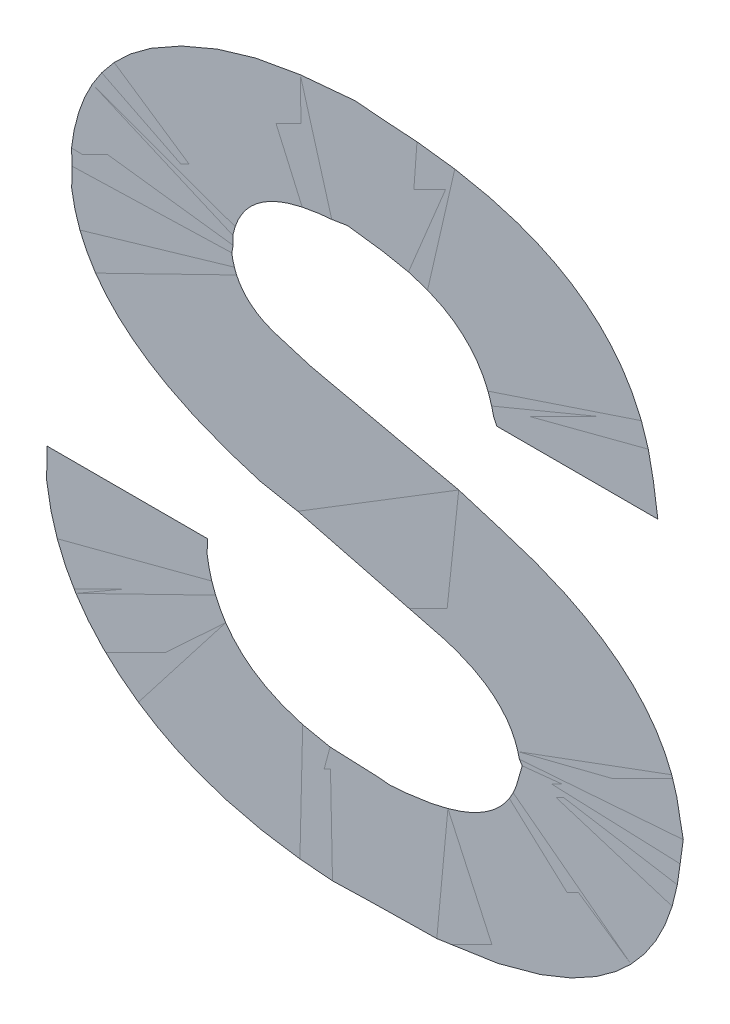
ISO-10303-21;
HEADER;
FILE_DESCRIPTION(('STEP AP214'),'2;1');
FILE_NAME('part.step','',(''),(''),'','','');
FILE_SCHEMA(('AUTOMOTIVE_DESIGN { 1 0 10303 214 1 1 1 1 }'));
ENDSEC;
DATA;
#1=APPLICATION_CONTEXT('core data for automotive mechanical design processes');
#2=APPLICATION_PROTOCOL_DEFINITION('international standard','automotive_design',2000,#1);
#3=PRODUCT_CONTEXT('',#1,'mechanical');
#4=PRODUCT('Part','Part','',(#3));
#5=PRODUCT_RELATED_PRODUCT_CATEGORY('part','',(#4));
#6=PRODUCT_DEFINITION_FORMATION('','',#4);
#7=PRODUCT_DEFINITION_CONTEXT('part definition',#1,'design');
#8=PRODUCT_DEFINITION('design','',#6,#7);
#9=PRODUCT_DEFINITION_SHAPE('','',#8);
#10=(LENGTH_UNIT() NAMED_UNIT(*) SI_UNIT(.MILLI.,.METRE.));
#11=(NAMED_UNIT(*) PLANE_ANGLE_UNIT() SI_UNIT($,.RADIAN.));
#12=(NAMED_UNIT(*) SI_UNIT($,.STERADIAN.) SOLID_ANGLE_UNIT());
#13=UNCERTAINTY_MEASURE_WITH_UNIT(LENGTH_MEASURE(1.E-05),#10,'distance_accuracy_value','');
#14=(GEOMETRIC_REPRESENTATION_CONTEXT(3) GLOBAL_UNCERTAINTY_ASSIGNED_CONTEXT((#13)) GLOBAL_UNIT_ASSIGNED_CONTEXT((#10,
#11,#12)) REPRESENTATION_CONTEXT('',''));
#15=CARTESIAN_POINT('',(0.,0.,0.));
#16=DIRECTION('',(0.,0.,1.));
#17=DIRECTION('',(1.,0.,0.));
#18=AXIS2_PLACEMENT_3D('',#15,#16,#17);
#19=CARTESIAN_POINT('',(-0.110404161724,0.771405147182,0.00045));
#20=DIRECTION('',(0.,0.,1.));
#21=DIRECTION('',(1.,0.,0.));
#22=AXIS2_PLACEMENT_3D('',#19,#20,#21);
#23=PLANE('',#22);
#24=CARTESIAN_POINT('',(-0.118370335149,0.807719203332,0.00045));
#25=CARTESIAN_POINT('',(-0.102137735696251,0.803973408793768,0.00045));
#26=CARTESIAN_POINT('',(-0.099843290192775,0.80323429342325,0.00045));
#27=CARTESIAN_POINT('',(-0.092115900013415,0.800745050228369,0.00045));
#28=CARTESIAN_POINT('',(-0.09135319969905,0.794696203597,0.00045));
#29=B_SPLINE_CURVE_WITH_KNOTS('',2,(#24,#25,#26,#27,#28),.UNSPECIFIED.,.F.,.F.,(3,2,3),(0.,0.5,
1.),.UNSPECIFIED.);
#30=CARTESIAN_POINT('',(-0.118370335149,0.807719203332,0.000225));
#31=VERTEX_POINT('',#30);
#32=CARTESIAN_POINT('',(-0.09135319969905,0.794696203597,0.000225));
#33=VERTEX_POINT('',#32);
#34=EDGE_CURVE('E194',#31,#33,#29,.T.);
#35=ORIENTED_EDGE('',*,*,#34,.T.);
#36=CARTESIAN_POINT('',(-0.09135319969905,0.794696203597,0.00045));
#37=CARTESIAN_POINT('',(-0.0923323395751359,0.785198670603582,0.00045));
#38=CARTESIAN_POINT('',(-0.109067324799,0.784871051035,0.00045));
#39=B_SPLINE_CURVE_WITH_KNOTS('',2,(#36,#37,#38),.UNSPECIFIED.,.F.,.F.,(3,3),(0.,1.),.UNSPECIFIED.);
#40=CARTESIAN_POINT('',(-0.109067324799,0.784871051035,0.000225));
#41=VERTEX_POINT('',#40);
#42=EDGE_CURVE('E28',#33,#41,#39,.T.);
#43=ORIENTED_EDGE('',*,*,#42,.T.);
#44=CARTESIAN_POINT('',(-0.109067324799,0.784871051035,0.00045));
#45=CARTESIAN_POINT('',(-0.128229526417618,0.785438130914285,0.00045));
#46=CARTESIAN_POINT('',(-0.129207257849,0.799429992707,0.00045));
#47=B_SPLINE_CURVE_WITH_KNOTS('',2,(#44,#45,#46),.UNSPECIFIED.,.F.,.F.,(3,3),(0.,1.),.UNSPECIFIED.);
#48=CARTESIAN_POINT('',(-0.129207257849,0.799429992707,0.000225));
#49=VERTEX_POINT('',#48);
#50=EDGE_CURVE('E11',#41,#49,#47,.T.);
#51=ORIENTED_EDGE('',*,*,#50,.T.);
#52=CARTESIAN_POINT('',(-0.129207257849,0.799429992707,0.00045));
#53=DIRECTION('',(-1.,0.,0.));
#54=VECTOR('',#53,1.);
#55=LINE('',#52,#54);
#56=CARTESIAN_POINT('',(-0.148579221899,0.799429992707,0.000225));
#57=VERTEX_POINT('',#56);
#58=EDGE_CURVE('E74',#49,#57,#55,.T.);
#59=ORIENTED_EDGE('',*,*,#58,.T.);
#60=CARTESIAN_POINT('',(-0.148579221899,0.799429992707,0.00045));
#61=CARTESIAN_POINT('',(-0.148480449426062,0.785807413250935,0.00045));
#62=CARTESIAN_POINT('',(-0.1368542088365,0.778137083283125,0.00045));
#63=CARTESIAN_POINT('',(-0.126650331158003,0.771405147182,0.00045));
#64=CARTESIAN_POINT('',(-0.109835293799,0.771405147182,0.00045));
#65=B_SPLINE_CURVE_WITH_KNOTS('',2,(#60,#61,#62,#63,#64),.UNSPECIFIED.,.F.,.F.,(3,2,3),(0.,0.5,
1.),.UNSPECIFIED.);
#66=CARTESIAN_POINT('',(-0.109835293799,0.771405147182,0.000225));
#67=VERTEX_POINT('',#66);
#68=EDGE_CURVE('E71',#57,#67,#65,.T.);
#69=ORIENTED_EDGE('',*,*,#68,.T.);
#70=CARTESIAN_POINT('',(-0.109835293799,0.771405147182,0.00045));
#71=CARTESIAN_POINT('',(-0.0725680846491953,0.771405147182,0.00045));
#72=CARTESIAN_POINT('',(-0.07197513964905,0.796687239112,0.00045));
#73=B_SPLINE_CURVE_WITH_KNOTS('',2,(#70,#71,#72),.UNSPECIFIED.,.F.,.F.,(3,3),(0.,1.),.UNSPECIFIED.);
#74=CARTESIAN_POINT('',(-0.07197513964905,0.796687239112,0.000225));
#75=VERTEX_POINT('',#74);
#76=EDGE_CURVE('E107',#67,#75,#73,.T.);
#77=ORIENTED_EDGE('',*,*,#76,.T.);
#78=CARTESIAN_POINT('',(-0.07197513964905,0.796687239112,0.00045));
#79=CARTESIAN_POINT('',(-0.0723843848430527,0.813913629320581,0.00045));
#80=CARTESIAN_POINT('',(-0.098998371099,0.819624784677,0.00045));
#81=B_SPLINE_CURVE_WITH_KNOTS('',2,(#78,#79,#80),.UNSPECIFIED.,.F.,.F.,(3,3),(0.,1.),.UNSPECIFIED.);
#82=CARTESIAN_POINT('',(-0.098998371099,0.819624784677,0.000225));
#83=VERTEX_POINT('',#82);
#84=EDGE_CURVE('E118',#75,#83,#81,.T.);
#85=ORIENTED_EDGE('',*,*,#84,.T.);
#86=CARTESIAN_POINT('',(-0.098998371099,0.819624784677,0.00045));
#87=CARTESIAN_POINT('',(-0.116307444493554,0.82347775276216,0.00045));
#88=CARTESIAN_POINT('',(-0.12112959826775,0.825214414801375,0.00045));
#89=CARTESIAN_POINT('',(-0.125858642301896,0.826917544075233,0.00045));
#90=CARTESIAN_POINT('',(-0.126147567499,0.831550683482,0.00045));
#91=B_SPLINE_CURVE_WITH_KNOTS('',2,(#86,#87,#88,#89,#90),.UNSPECIFIED.,.F.,.F.,(3,2,3),(0.,0.5,
1.),.UNSPECIFIED.);
#92=CARTESIAN_POINT('',(-0.126147567499,0.831550683482,0.000225));
#93=VERTEX_POINT('',#92);
#94=EDGE_CURVE('E129',#83,#93,#91,.T.);
#95=ORIENTED_EDGE('',*,*,#94,.T.);
#96=CARTESIAN_POINT('',(-0.126147567499,0.831550683482,0.00045));
#97=CARTESIAN_POINT('',(-0.125407845331041,0.840127366447839,0.00045));
#98=CARTESIAN_POINT('',(-0.112385034699,0.840490028062,0.00045));
#99=B_SPLINE_CURVE_WITH_KNOTS('',2,(#96,#97,#98),.UNSPECIFIED.,.F.,.F.,(3,3),(0.,1.),.UNSPECIFIED.);
#100=CARTESIAN_POINT('',(-0.112385034699,0.840490028062,0.000225));
#101=VERTEX_POINT('',#100);
#102=EDGE_CURVE('E140',#93,#101,#99,.T.);
#103=ORIENTED_EDGE('',*,*,#102,.T.);
#104=CARTESIAN_POINT('',(-0.112385034699,0.840490028062,0.00045));
#105=CARTESIAN_POINT('',(-0.0959207399729902,0.840151967192334,0.00045));
#106=CARTESIAN_POINT('',(-0.09441085804905,0.828564129257,0.00045));
#107=B_SPLINE_CURVE_WITH_KNOTS('',2,(#104,#105,#106),.UNSPECIFIED.,.F.,.F.,(3,3),(0.,1.),.UNSPECIFIED.);
#108=CARTESIAN_POINT('',(-0.09441085804905,0.828564129257,0.000225));
#109=VERTEX_POINT('',#108);
#110=EDGE_CURVE('E151',#101,#109,#107,.T.);
#111=ORIENTED_EDGE('',*,*,#110,.T.);
#112=CARTESIAN_POINT('',(-0.09441085804905,0.828564129257,0.00045));
#113=DIRECTION('',(1.,0.,0.));
#114=VECTOR('',#113,1.);
#115=LINE('',#112,#114);
#116=CARTESIAN_POINT('',(-0.07503482999895,0.828564129257,0.000225));
#117=VERTEX_POINT('',#116);
#118=EDGE_CURVE('E212',#109,#117,#115,.T.);
#119=ORIENTED_EDGE('',*,*,#118,.T.);
#120=CARTESIAN_POINT('',(-0.07503482999895,0.828564129257,0.00045));
#121=CARTESIAN_POINT('',(-0.0755423321327005,0.853959997947,0.00045));
#122=CARTESIAN_POINT('',(-0.111491100749,0.853959997947,0.00045));
#123=B_SPLINE_CURVE_WITH_KNOTS('',2,(#120,#121,#122),.UNSPECIFIED.,.F.,.F.,(3,3),(0.,1.),.UNSPECIFIED.);
#124=CARTESIAN_POINT('',(-0.111491100749,0.853959997947,0.000225));
#125=VERTEX_POINT('',#124);
#126=EDGE_CURVE('E163',#117,#125,#123,.T.);
#127=ORIENTED_EDGE('',*,*,#126,.T.);
#128=CARTESIAN_POINT('',(-0.111491100749,0.853959997947,0.00045));
#129=CARTESIAN_POINT('',(-0.124640914999547,0.853959997947,0.00045));
#130=CARTESIAN_POINT('',(-0.13467219564275,0.84807577441575,0.00045));
#131=CARTESIAN_POINT('',(-0.145189128882413,0.841906673156746,0.00045));
#132=CARTESIAN_POINT('',(-0.145521563549,0.830108197797,0.00045));
#133=B_SPLINE_CURVE_WITH_KNOTS('',2,(#128,#129,#130,#131,#132),.UNSPECIFIED.,.F.,.F.,(3,2,3),
(0.,0.5,1.),.UNSPECIFIED.);
#134=CARTESIAN_POINT('',(-0.145521563549,0.830108197797,0.000225));
#135=VERTEX_POINT('',#134);
#136=EDGE_CURVE('E174',#125,#135,#133,.T.);
#137=ORIENTED_EDGE('',*,*,#136,.T.);
#138=CARTESIAN_POINT('',(-0.145521563549,0.830108197797,0.00045));
#139=CARTESIAN_POINT('',(-0.145131871041566,0.813834284962875,0.00045));
#140=CARTESIAN_POINT('',(-0.118370335149,0.807719203332,0.00045));
#141=B_SPLINE_CURVE_WITH_KNOTS('',2,(#138,#139,#140),.UNSPECIFIED.,.F.,.F.,(3,3),(0.,1.),.UNSPECIFIED.);
#142=EDGE_CURVE('E184',#135,#31,#141,.T.);
#143=ORIENTED_EDGE('',*,*,#142,.T.);
#144=EDGE_LOOP('',(#35,#43,#51,#59,#69,#77,#85,#95,#103,#111,#119,#127,#137,#143));
#145=FACE_BOUND('',#144,.T.);
#146=ADVANCED_FACE('F17',(#145),#23,.T.);
#147=CARTESIAN_POINT('',(-0.110404161724,0.771405147182,0.));
#148=DIRECTION('',(0.,0.,1.));
#149=DIRECTION('',(1.,0.,0.));
#150=AXIS2_PLACEMENT_3D('',#147,#148,#149);
#151=PLANE('',#150);
#152=ORIENTED_EDGE('',*,*,#42,.F.);
#153=ORIENTED_EDGE('',*,*,#34,.F.);
#154=ORIENTED_EDGE('',*,*,#142,.F.);
#155=ORIENTED_EDGE('',*,*,#136,.F.);
#156=ORIENTED_EDGE('',*,*,#126,.F.);
#157=ORIENTED_EDGE('',*,*,#118,.F.);
#158=ORIENTED_EDGE('',*,*,#110,.F.);
#159=ORIENTED_EDGE('',*,*,#102,.F.);
#160=ORIENTED_EDGE('',*,*,#94,.F.);
#161=ORIENTED_EDGE('',*,*,#84,.F.);
#162=ORIENTED_EDGE('',*,*,#76,.F.);
#163=ORIENTED_EDGE('',*,*,#68,.F.);
#164=ORIENTED_EDGE('',*,*,#58,.F.);
#165=ORIENTED_EDGE('',*,*,#50,.F.);
#166=EDGE_LOOP('',(#152,#153,#154,#155,#156,#157,#158,#159,#160,#161,#162,#163,#164,#165));
#167=FACE_BOUND('',#166,.T.);
#168=ADVANCED_FACE('F76',(#167),#151,.F.);
#169=CLOSED_SHELL('',(#146,#168));
#170=MANIFOLD_SOLID_BREP('B1',#169);
#171=ADVANCED_BREP_SHAPE_REPRESENTATION('',(#18,#170),#14);
#172=SHAPE_DEFINITION_REPRESENTATION(#9,#171);
ENDSEC;
END-ISO-10303-21;
